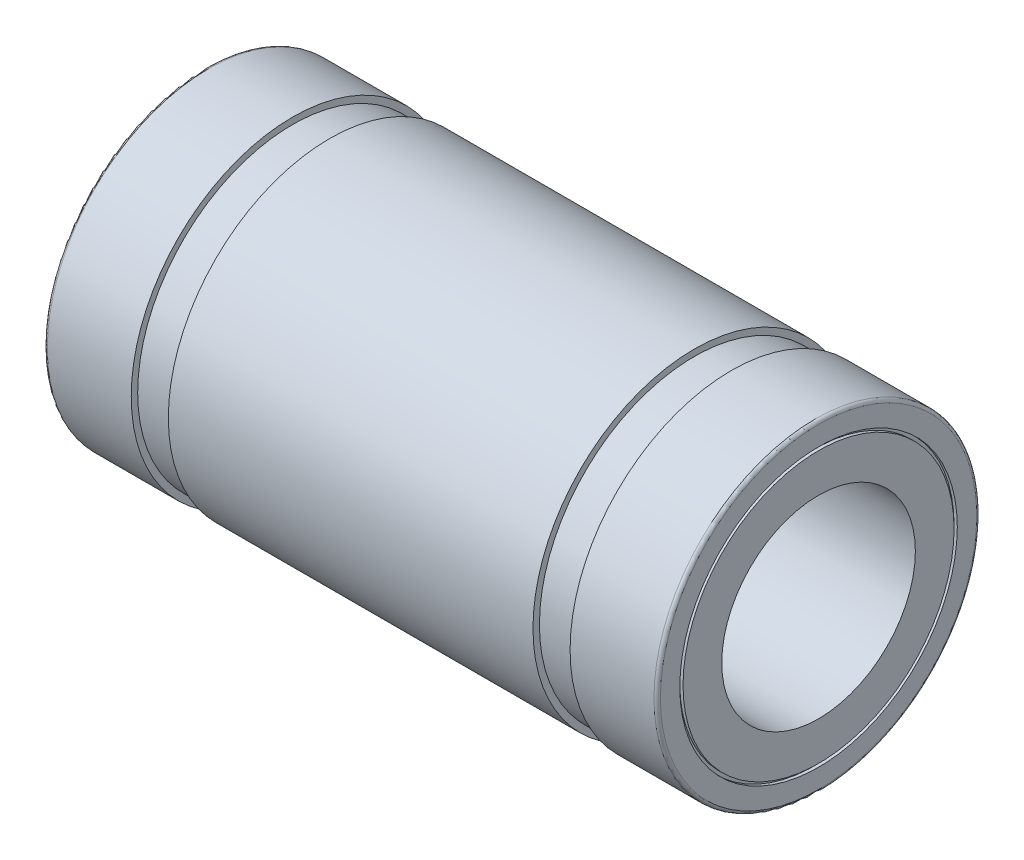
ISO-10303-21;
HEADER;
FILE_DESCRIPTION(('STEP AP214'),'2;1');
FILE_NAME('part.step','',(''),(''),'','','');
FILE_SCHEMA(('AUTOMOTIVE_DESIGN { 1 0 10303 214 1 1 1 1 }'));
ENDSEC;
DATA;
#1=APPLICATION_CONTEXT('core data for automotive mechanical design processes');
#2=APPLICATION_PROTOCOL_DEFINITION('international standard','automotive_design',2000,#1);
#3=PRODUCT_CONTEXT('',#1,'mechanical');
#4=PRODUCT('Part','Part','',(#3));
#5=PRODUCT_RELATED_PRODUCT_CATEGORY('part','',(#4));
#6=PRODUCT_DEFINITION_FORMATION('','',#4);
#7=PRODUCT_DEFINITION_CONTEXT('part definition',#1,'design');
#8=PRODUCT_DEFINITION('design','',#6,#7);
#9=PRODUCT_DEFINITION_SHAPE('','',#8);
#10=(LENGTH_UNIT() NAMED_UNIT(*) SI_UNIT(.MILLI.,.METRE.));
#11=(NAMED_UNIT(*) PLANE_ANGLE_UNIT() SI_UNIT($,.RADIAN.));
#12=(NAMED_UNIT(*) SI_UNIT($,.STERADIAN.) SOLID_ANGLE_UNIT());
#13=UNCERTAINTY_MEASURE_WITH_UNIT(LENGTH_MEASURE(1.E-05),#10,'distance_accuracy_value','');
#14=(GEOMETRIC_REPRESENTATION_CONTEXT(3) GLOBAL_UNCERTAINTY_ASSIGNED_CONTEXT((#13)) GLOBAL_UNIT_ASSIGNED_CONTEXT((#10,
#11,#12)) REPRESENTATION_CONTEXT('',''));
#15=CARTESIAN_POINT('',(0.,0.,0.));
#16=DIRECTION('',(0.,0.,1.));
#17=DIRECTION('',(1.,0.,0.));
#18=AXIS2_PLACEMENT_3D('',#15,#16,#17);
#19=CARTESIAN_POINT('',(9.4,4.3,0.));
#20=DIRECTION('',(1.,0.,0.));
#21=DIRECTION('',(0.,0.,-1.));
#22=AXIS2_PLACEMENT_3D('',#19,#20,#21);
#23=PLANE('',#22);
#24=CARTESIAN_POINT('',(9.4,0.,0.));
#25=DIRECTION('',(-1.,0.,0.));
#26=DIRECTION('',(0.,0.,1.));
#27=AXIS2_PLACEMENT_3D('',#24,#25,#26);
#28=CIRCLE('',#27,4.2);
#29=CARTESIAN_POINT('',(9.4,0.,4.2));
#30=VERTEX_POINT('',#29);
#31=EDGE_CURVE('E10',#30,#30,#28,.T.);
#32=ORIENTED_EDGE('',*,*,#31,.T.);
#33=EDGE_LOOP('',(#32));
#34=FACE_BOUND('',#33,.T.);
#35=CARTESIAN_POINT('',(9.4,0.,0.));
#36=DIRECTION('',(-1.,0.,0.));
#37=DIRECTION('',(0.,0.,1.));
#38=AXIS2_PLACEMENT_3D('',#35,#36,#37);
#39=CIRCLE('',#38,4.3);
#40=CARTESIAN_POINT('',(9.4,0.,4.3));
#41=VERTEX_POINT('',#40);
#42=EDGE_CURVE('E101',#41,#41,#39,.T.);
#43=ORIENTED_EDGE('',*,*,#42,.F.);
#44=EDGE_LOOP('',(#43));
#45=FACE_BOUND('',#44,.T.);
#46=ADVANCED_FACE('F31',(#34,#45),#23,.T.);
#47=CARTESIAN_POINT('',(9.50000000000015,0.,0.));
#48=DIRECTION('',(-1.,0.,0.));
#49=DIRECTION('',(0.,0.,1.));
#50=AXIS2_PLACEMENT_3D('',#47,#48,#49);
#51=CYLINDRICAL_SURFACE('',#50,4.2);
#52=CARTESIAN_POINT('',(9.5,0.,0.));
#53=DIRECTION('',(-1.,0.,0.));
#54=DIRECTION('',(0.,0.,1.));
#55=AXIS2_PLACEMENT_3D('',#52,#53,#54);
#56=CIRCLE('',#55,4.2);
#57=CARTESIAN_POINT('',(9.5,0.,4.2));
#58=VERTEX_POINT('',#57);
#59=EDGE_CURVE('E37',#58,#58,#56,.T.);
#60=ORIENTED_EDGE('',*,*,#59,.T.);
#61=EDGE_LOOP('',(#60));
#62=FACE_BOUND('',#61,.T.);
#63=ORIENTED_EDGE('',*,*,#31,.F.);
#64=EDGE_LOOP('',(#63));
#65=FACE_BOUND('',#64,.T.);
#66=ADVANCED_FACE('F109',(#62,#65),#51,.T.);
#67=CARTESIAN_POINT('',(9.5,4.2,0.));
#68=DIRECTION('',(1.,0.,0.));
#69=DIRECTION('',(0.,0.,-1.));
#70=AXIS2_PLACEMENT_3D('',#67,#68,#69);
#71=PLANE('',#70);
#72=CARTESIAN_POINT('',(9.5,0.,0.));
#73=DIRECTION('',(-1.,0.,0.));
#74=DIRECTION('',(0.,0.,1.));
#75=AXIS2_PLACEMENT_3D('',#72,#73,#74);
#76=CIRCLE('',#75,3.);
#77=CARTESIAN_POINT('',(9.5,0.,3.));
#78=VERTEX_POINT('',#77);
#79=EDGE_CURVE('E41',#78,#78,#76,.T.);
#80=ORIENTED_EDGE('',*,*,#79,.T.);
#81=EDGE_LOOP('',(#80));
#82=FACE_BOUND('',#81,.T.);
#83=ORIENTED_EDGE('',*,*,#59,.F.);
#84=EDGE_LOOP('',(#83));
#85=FACE_BOUND('',#84,.T.);
#86=ADVANCED_FACE('F113',(#82,#85),#71,.T.);
#87=CARTESIAN_POINT('',(9.50000000000015,0.,0.));
#88=DIRECTION('',(-1.,0.,0.));
#89=DIRECTION('',(0.,0.,1.));
#90=AXIS2_PLACEMENT_3D('',#87,#88,#89);
#91=CYLINDRICAL_SURFACE('',#90,3.);
#92=CARTESIAN_POINT('',(-9.5,0.,0.));
#93=DIRECTION('',(-1.,0.,0.));
#94=DIRECTION('',(0.,0.,1.));
#95=AXIS2_PLACEMENT_3D('',#92,#93,#94);
#96=CIRCLE('',#95,3.);
#97=CARTESIAN_POINT('',(-9.5,0.,3.));
#98=VERTEX_POINT('',#97);
#99=EDGE_CURVE('E45',#98,#98,#96,.T.);
#100=ORIENTED_EDGE('',*,*,#99,.T.);
#101=EDGE_LOOP('',(#100));
#102=FACE_BOUND('',#101,.T.);
#103=ORIENTED_EDGE('',*,*,#79,.F.);
#104=EDGE_LOOP('',(#103));
#105=FACE_BOUND('',#104,.T.);
#106=ADVANCED_FACE('F117',(#102,#105),#91,.F.);
#107=CARTESIAN_POINT('',(-9.5,3.,0.));
#108=DIRECTION('',(-1.,0.,0.));
#109=DIRECTION('',(0.,0.,1.));
#110=AXIS2_PLACEMENT_3D('',#107,#108,#109);
#111=PLANE('',#110);
#112=CARTESIAN_POINT('',(-9.5,0.,0.));
#113=DIRECTION('',(-1.,0.,0.));
#114=DIRECTION('',(0.,0.,1.));
#115=AXIS2_PLACEMENT_3D('',#112,#113,#114);
#116=CIRCLE('',#115,4.2);
#117=CARTESIAN_POINT('',(-9.5,0.,4.2));
#118=VERTEX_POINT('',#117);
#119=EDGE_CURVE('E50',#118,#118,#116,.T.);
#120=ORIENTED_EDGE('',*,*,#119,.T.);
#121=EDGE_LOOP('',(#120));
#122=FACE_BOUND('',#121,.T.);
#123=ORIENTED_EDGE('',*,*,#99,.F.);
#124=EDGE_LOOP('',(#123));
#125=FACE_BOUND('',#124,.T.);
#126=ADVANCED_FACE('F124',(#122,#125),#111,.T.);
#127=CARTESIAN_POINT('',(9.50000000000015,0.,0.));
#128=DIRECTION('',(-1.,0.,0.));
#129=DIRECTION('',(0.,0.,1.));
#130=AXIS2_PLACEMENT_3D('',#127,#128,#129);
#131=CYLINDRICAL_SURFACE('',#130,4.2);
#132=CARTESIAN_POINT('',(-9.4,0.,0.));
#133=DIRECTION('',(-1.,0.,0.));
#134=DIRECTION('',(0.,0.,1.));
#135=AXIS2_PLACEMENT_3D('',#132,#133,#134);
#136=CIRCLE('',#135,4.2);
#137=CARTESIAN_POINT('',(-9.4,0.,4.2));
#138=VERTEX_POINT('',#137);
#139=EDGE_CURVE('E53',#138,#138,#136,.T.);
#140=ORIENTED_EDGE('',*,*,#139,.T.);
#141=EDGE_LOOP('',(#140));
#142=FACE_BOUND('',#141,.T.);
#143=ORIENTED_EDGE('',*,*,#119,.F.);
#144=EDGE_LOOP('',(#143));
#145=FACE_BOUND('',#144,.T.);
#146=ADVANCED_FACE('F128',(#142,#145),#131,.T.);
#147=CARTESIAN_POINT('',(-9.4,4.2,0.));
#148=DIRECTION('',(-1.,0.,0.));
#149=DIRECTION('',(0.,0.,1.));
#150=AXIS2_PLACEMENT_3D('',#147,#148,#149);
#151=PLANE('',#150);
#152=CARTESIAN_POINT('',(-9.4,0.,0.));
#153=DIRECTION('',(-1.,0.,0.));
#154=DIRECTION('',(0.,0.,1.));
#155=AXIS2_PLACEMENT_3D('',#152,#153,#154);
#156=CIRCLE('',#155,4.3);
#157=CARTESIAN_POINT('',(-9.4,0.,4.3));
#158=VERTEX_POINT('',#157);
#159=EDGE_CURVE('E56',#158,#158,#156,.T.);
#160=ORIENTED_EDGE('',*,*,#159,.T.);
#161=EDGE_LOOP('',(#160));
#162=FACE_BOUND('',#161,.T.);
#163=ORIENTED_EDGE('',*,*,#139,.F.);
#164=EDGE_LOOP('',(#163));
#165=FACE_BOUND('',#164,.T.);
#166=ADVANCED_FACE('F132',(#162,#165),#151,.T.);
#167=CARTESIAN_POINT('',(9.50000000000015,0.,0.));
#168=DIRECTION('',(-1.,0.,0.));
#169=DIRECTION('',(0.,0.,1.));
#170=AXIS2_PLACEMENT_3D('',#167,#168,#169);
#171=CYLINDRICAL_SURFACE('',#170,4.3);
#172=CARTESIAN_POINT('',(-9.5,0.,0.));
#173=DIRECTION('',(-1.,0.,0.));
#174=DIRECTION('',(0.,0.,1.));
#175=AXIS2_PLACEMENT_3D('',#172,#173,#174);
#176=CIRCLE('',#175,4.3);
#177=CARTESIAN_POINT('',(-9.5,0.,4.3));
#178=VERTEX_POINT('',#177);
#179=EDGE_CURVE('E59',#178,#178,#176,.T.);
#180=ORIENTED_EDGE('',*,*,#179,.T.);
#181=EDGE_LOOP('',(#180));
#182=FACE_BOUND('',#181,.T.);
#183=ORIENTED_EDGE('',*,*,#159,.F.);
#184=EDGE_LOOP('',(#183));
#185=FACE_BOUND('',#184,.T.);
#186=ADVANCED_FACE('F136',(#182,#185),#171,.F.);
#187=CARTESIAN_POINT('',(-9.5,4.3,0.));
#188=DIRECTION('',(-1.,0.,0.));
#189=DIRECTION('',(0.,0.,1.));
#190=AXIS2_PLACEMENT_3D('',#187,#188,#189);
#191=PLANE('',#190);
#192=CARTESIAN_POINT('',(-9.5,0.,0.));
#193=DIRECTION('',(-1.,0.,0.));
#194=DIRECTION('',(0.,0.,1.));
#195=AXIS2_PLACEMENT_3D('',#192,#193,#194);
#196=CIRCLE('',#195,4.9);
#197=CARTESIAN_POINT('',(-9.5,0.,4.9));
#198=VERTEX_POINT('',#197);
#199=EDGE_CURVE('E62',#198,#198,#196,.T.);
#200=ORIENTED_EDGE('',*,*,#199,.T.);
#201=EDGE_LOOP('',(#200));
#202=FACE_BOUND('',#201,.T.);
#203=ORIENTED_EDGE('',*,*,#179,.F.);
#204=EDGE_LOOP('',(#203));
#205=FACE_BOUND('',#204,.T.);
#206=ADVANCED_FACE('F140',(#202,#205),#191,.T.);
#207=CARTESIAN_POINT('',(-9.40000000000015,0.,0.));
#208=DIRECTION('',(-1.,0.,0.));
#209=DIRECTION('',(0.,0.,1.));
#210=AXIS2_PLACEMENT_3D('',#207,#208,#209);
#211=TOROIDAL_SURFACE('',#210,4.9,0.0999999999999252);
#212=CARTESIAN_POINT('',(-9.4,0.,0.));
#213=DIRECTION('',(-1.,0.,0.));
#214=DIRECTION('',(0.,0.,1.));
#215=AXIS2_PLACEMENT_3D('',#212,#213,#214);
#216=CIRCLE('',#215,4.99999999999993);
#217=CARTESIAN_POINT('',(-9.4,0.,4.99999999999993));
#218=VERTEX_POINT('',#217);
#219=EDGE_CURVE('E65',#218,#218,#216,.T.);
#220=ORIENTED_EDGE('',*,*,#219,.T.);
#221=EDGE_LOOP('',(#220));
#222=FACE_BOUND('',#221,.T.);
#223=ORIENTED_EDGE('',*,*,#199,.F.);
#224=EDGE_LOOP('',(#223));
#225=FACE_BOUND('',#224,.T.);
#226=ADVANCED_FACE('F144',(#222,#225),#211,.T.);
#227=CARTESIAN_POINT('',(9.50000000000015,0.,0.));
#228=DIRECTION('',(-1.,0.,0.));
#229=DIRECTION('',(0.,0.,1.));
#230=AXIS2_PLACEMENT_3D('',#227,#228,#229);
#231=CYLINDRICAL_SURFACE('',#230,4.99999999999996);
#232=CARTESIAN_POINT('',(-6.8,0.,0.));
#233=DIRECTION('',(-1.,0.,0.));
#234=DIRECTION('',(0.,0.,1.));
#235=AXIS2_PLACEMENT_3D('',#232,#233,#234);
#236=CIRCLE('',#235,5.);
#237=CARTESIAN_POINT('',(-6.8,0.,5.));
#238=VERTEX_POINT('',#237);
#239=EDGE_CURVE('E68',#238,#238,#236,.T.);
#240=ORIENTED_EDGE('',*,*,#239,.T.);
#241=EDGE_LOOP('',(#240));
#242=FACE_BOUND('',#241,.T.);
#243=ORIENTED_EDGE('',*,*,#219,.F.);
#244=EDGE_LOOP('',(#243));
#245=FACE_BOUND('',#244,.T.);
#246=ADVANCED_FACE('F148',(#242,#245),#231,.T.);
#247=CARTESIAN_POINT('',(-6.8,5.,0.));
#248=DIRECTION('',(1.,0.,0.));
#249=DIRECTION('',(0.,0.,-1.));
#250=AXIS2_PLACEMENT_3D('',#247,#248,#249);
#251=PLANE('',#250);
#252=CARTESIAN_POINT('',(-6.8,0.,0.));
#253=DIRECTION('',(-1.,0.,0.));
#254=DIRECTION('',(0.,0.,1.));
#255=AXIS2_PLACEMENT_3D('',#252,#253,#254);
#256=CIRCLE('',#255,4.8);
#257=CARTESIAN_POINT('',(-6.8,0.,4.8));
#258=VERTEX_POINT('',#257);
#259=EDGE_CURVE('E71',#258,#258,#256,.T.);
#260=ORIENTED_EDGE('',*,*,#259,.T.);
#261=EDGE_LOOP('',(#260));
#262=FACE_BOUND('',#261,.T.);
#263=ORIENTED_EDGE('',*,*,#239,.F.);
#264=EDGE_LOOP('',(#263));
#265=FACE_BOUND('',#264,.T.);
#266=ADVANCED_FACE('F152',(#262,#265),#251,.T.);
#267=CARTESIAN_POINT('',(9.50000000000015,0.,0.));
#268=DIRECTION('',(-1.,0.,0.));
#269=DIRECTION('',(0.,0.,1.));
#270=AXIS2_PLACEMENT_3D('',#267,#268,#269);
#271=CYLINDRICAL_SURFACE('',#270,4.8);
#272=CARTESIAN_POINT('',(-5.65,0.,0.));
#273=DIRECTION('',(-1.,0.,0.));
#274=DIRECTION('',(0.,0.,1.));
#275=AXIS2_PLACEMENT_3D('',#272,#273,#274);
#276=CIRCLE('',#275,4.8);
#277=CARTESIAN_POINT('',(-5.65,0.,4.8));
#278=VERTEX_POINT('',#277);
#279=EDGE_CURVE('E74',#278,#278,#276,.T.);
#280=ORIENTED_EDGE('',*,*,#279,.T.);
#281=EDGE_LOOP('',(#280));
#282=FACE_BOUND('',#281,.T.);
#283=ORIENTED_EDGE('',*,*,#259,.F.);
#284=EDGE_LOOP('',(#283));
#285=FACE_BOUND('',#284,.T.);
#286=ADVANCED_FACE('F156',(#282,#285),#271,.T.);
#287=CARTESIAN_POINT('',(-5.65,4.8,0.));
#288=DIRECTION('',(-1.,0.,0.));
#289=DIRECTION('',(0.,0.,1.));
#290=AXIS2_PLACEMENT_3D('',#287,#288,#289);
#291=PLANE('',#290);
#292=CARTESIAN_POINT('',(-5.65,0.,0.));
#293=DIRECTION('',(-1.,0.,0.));
#294=DIRECTION('',(0.,0.,1.));
#295=AXIS2_PLACEMENT_3D('',#292,#293,#294);
#296=CIRCLE('',#295,5.);
#297=CARTESIAN_POINT('',(-5.65,0.,5.));
#298=VERTEX_POINT('',#297);
#299=EDGE_CURVE('E77',#298,#298,#296,.T.);
#300=ORIENTED_EDGE('',*,*,#299,.T.);
#301=EDGE_LOOP('',(#300));
#302=FACE_BOUND('',#301,.T.);
#303=ORIENTED_EDGE('',*,*,#279,.F.);
#304=EDGE_LOOP('',(#303));
#305=FACE_BOUND('',#304,.T.);
#306=ADVANCED_FACE('F160',(#302,#305),#291,.T.);
#307=CARTESIAN_POINT('',(9.50000000000015,0.,0.));
#308=DIRECTION('',(-1.,0.,0.));
#309=DIRECTION('',(0.,0.,1.));
#310=AXIS2_PLACEMENT_3D('',#307,#308,#309);
#311=CYLINDRICAL_SURFACE('',#310,5.);
#312=CARTESIAN_POINT('',(5.65,0.,0.));
#313=DIRECTION('',(-1.,0.,0.));
#314=DIRECTION('',(0.,0.,1.));
#315=AXIS2_PLACEMENT_3D('',#312,#313,#314);
#316=CIRCLE('',#315,5.);
#317=CARTESIAN_POINT('',(5.65,0.,5.));
#318=VERTEX_POINT('',#317);
#319=EDGE_CURVE('E80',#318,#318,#316,.T.);
#320=ORIENTED_EDGE('',*,*,#319,.T.);
#321=EDGE_LOOP('',(#320));
#322=FACE_BOUND('',#321,.T.);
#323=ORIENTED_EDGE('',*,*,#299,.F.);
#324=EDGE_LOOP('',(#323));
#325=FACE_BOUND('',#324,.T.);
#326=ADVANCED_FACE('F164',(#322,#325),#311,.T.);
#327=CARTESIAN_POINT('',(5.65,5.,0.));
#328=DIRECTION('',(1.,0.,0.));
#329=DIRECTION('',(0.,0.,-1.));
#330=AXIS2_PLACEMENT_3D('',#327,#328,#329);
#331=PLANE('',#330);
#332=CARTESIAN_POINT('',(5.65,0.,0.));
#333=DIRECTION('',(-1.,0.,0.));
#334=DIRECTION('',(0.,0.,1.));
#335=AXIS2_PLACEMENT_3D('',#332,#333,#334);
#336=CIRCLE('',#335,4.8);
#337=CARTESIAN_POINT('',(5.65,0.,4.8));
#338=VERTEX_POINT('',#337);
#339=EDGE_CURVE('E83',#338,#338,#336,.T.);
#340=ORIENTED_EDGE('',*,*,#339,.T.);
#341=EDGE_LOOP('',(#340));
#342=FACE_BOUND('',#341,.T.);
#343=ORIENTED_EDGE('',*,*,#319,.F.);
#344=EDGE_LOOP('',(#343));
#345=FACE_BOUND('',#344,.T.);
#346=ADVANCED_FACE('F168',(#342,#345),#331,.T.);
#347=CARTESIAN_POINT('',(9.50000000000015,0.,0.));
#348=DIRECTION('',(-1.,0.,0.));
#349=DIRECTION('',(0.,0.,1.));
#350=AXIS2_PLACEMENT_3D('',#347,#348,#349);
#351=CYLINDRICAL_SURFACE('',#350,4.8);
#352=CARTESIAN_POINT('',(6.8,0.,0.));
#353=DIRECTION('',(-1.,0.,0.));
#354=DIRECTION('',(0.,0.,1.));
#355=AXIS2_PLACEMENT_3D('',#352,#353,#354);
#356=CIRCLE('',#355,4.8);
#357=CARTESIAN_POINT('',(6.8,0.,4.8));
#358=VERTEX_POINT('',#357);
#359=EDGE_CURVE('E86',#358,#358,#356,.T.);
#360=ORIENTED_EDGE('',*,*,#359,.T.);
#361=EDGE_LOOP('',(#360));
#362=FACE_BOUND('',#361,.T.);
#363=ORIENTED_EDGE('',*,*,#339,.F.);
#364=EDGE_LOOP('',(#363));
#365=FACE_BOUND('',#364,.T.);
#366=ADVANCED_FACE('F172',(#362,#365),#351,.T.);
#367=CARTESIAN_POINT('',(6.8,4.8,0.));
#368=DIRECTION('',(-1.,0.,0.));
#369=DIRECTION('',(0.,0.,1.));
#370=AXIS2_PLACEMENT_3D('',#367,#368,#369);
#371=PLANE('',#370);
#372=CARTESIAN_POINT('',(6.8,0.,0.));
#373=DIRECTION('',(-1.,0.,0.));
#374=DIRECTION('',(0.,0.,1.));
#375=AXIS2_PLACEMENT_3D('',#372,#373,#374);
#376=CIRCLE('',#375,5.);
#377=CARTESIAN_POINT('',(6.8,0.,5.));
#378=VERTEX_POINT('',#377);
#379=EDGE_CURVE('E89',#378,#378,#376,.T.);
#380=ORIENTED_EDGE('',*,*,#379,.T.);
#381=EDGE_LOOP('',(#380));
#382=FACE_BOUND('',#381,.T.);
#383=ORIENTED_EDGE('',*,*,#359,.F.);
#384=EDGE_LOOP('',(#383));
#385=FACE_BOUND('',#384,.T.);
#386=ADVANCED_FACE('F176',(#382,#385),#371,.T.);
#387=CARTESIAN_POINT('',(9.50000000000015,0.,0.));
#388=DIRECTION('',(-1.,0.,0.));
#389=DIRECTION('',(0.,0.,1.));
#390=AXIS2_PLACEMENT_3D('',#387,#388,#389);
#391=CYLINDRICAL_SURFACE('',#390,5.);
#392=CARTESIAN_POINT('',(9.4,0.,0.));
#393=DIRECTION('',(-1.,0.,0.));
#394=DIRECTION('',(0.,0.,1.));
#395=AXIS2_PLACEMENT_3D('',#392,#393,#394);
#396=CIRCLE('',#395,5.);
#397=CARTESIAN_POINT('',(9.4,0.,5.));
#398=VERTEX_POINT('',#397);
#399=EDGE_CURVE('E92',#398,#398,#396,.T.);
#400=ORIENTED_EDGE('',*,*,#399,.T.);
#401=EDGE_LOOP('',(#400));
#402=FACE_BOUND('',#401,.T.);
#403=ORIENTED_EDGE('',*,*,#379,.F.);
#404=EDGE_LOOP('',(#403));
#405=FACE_BOUND('',#404,.T.);
#406=ADVANCED_FACE('F180',(#402,#405),#391,.T.);
#407=CARTESIAN_POINT('',(9.40000000000015,0.,0.));
#408=DIRECTION('',(-1.,0.,0.));
#409=DIRECTION('',(0.,0.,1.));
#410=AXIS2_PLACEMENT_3D('',#407,#408,#409);
#411=TOROIDAL_SURFACE('',#410,4.9,0.0999999999999621);
#412=CARTESIAN_POINT('',(9.50000000000011,0.,0.));
#413=DIRECTION('',(-1.,0.,0.));
#414=DIRECTION('',(0.,0.,1.));
#415=AXIS2_PLACEMENT_3D('',#412,#413,#414);
#416=CIRCLE('',#415,4.9);
#417=CARTESIAN_POINT('',(9.50000000000011,0.,4.9));
#418=VERTEX_POINT('',#417);
#419=EDGE_CURVE('E95',#418,#418,#416,.T.);
#420=ORIENTED_EDGE('',*,*,#419,.T.);
#421=EDGE_LOOP('',(#420));
#422=FACE_BOUND('',#421,.T.);
#423=ORIENTED_EDGE('',*,*,#399,.F.);
#424=EDGE_LOOP('',(#423));
#425=FACE_BOUND('',#424,.T.);
#426=ADVANCED_FACE('F184',(#422,#425),#411,.T.);
#427=CARTESIAN_POINT('',(9.50000000000006,4.9,0.));
#428=DIRECTION('',(1.,0.,0.));
#429=DIRECTION('',(0.,0.,-1.));
#430=AXIS2_PLACEMENT_3D('',#427,#428,#429);
#431=PLANE('',#430);
#432=CARTESIAN_POINT('',(9.5,0.,0.));
#433=DIRECTION('',(-1.,0.,0.));
#434=DIRECTION('',(0.,0.,1.));
#435=AXIS2_PLACEMENT_3D('',#432,#433,#434);
#436=CIRCLE('',#435,4.3);
#437=CARTESIAN_POINT('',(9.5,0.,4.3));
#438=VERTEX_POINT('',#437);
#439=EDGE_CURVE('E98',#438,#438,#436,.T.);
#440=ORIENTED_EDGE('',*,*,#439,.T.);
#441=EDGE_LOOP('',(#440));
#442=FACE_BOUND('',#441,.T.);
#443=ORIENTED_EDGE('',*,*,#419,.F.);
#444=EDGE_LOOP('',(#443));
#445=FACE_BOUND('',#444,.T.);
#446=ADVANCED_FACE('F188',(#442,#445),#431,.T.);
#447=CARTESIAN_POINT('',(9.50000000000015,0.,0.));
#448=DIRECTION('',(-1.,0.,0.));
#449=DIRECTION('',(0.,0.,1.));
#450=AXIS2_PLACEMENT_3D('',#447,#448,#449);
#451=CYLINDRICAL_SURFACE('',#450,4.3);
#452=ORIENTED_EDGE('',*,*,#42,.T.);
#453=EDGE_LOOP('',(#452));
#454=FACE_BOUND('',#453,.T.);
#455=ORIENTED_EDGE('',*,*,#439,.F.);
#456=EDGE_LOOP('',(#455));
#457=FACE_BOUND('',#456,.T.);
#458=ADVANCED_FACE('F105',(#454,#457),#451,.F.);
#459=CLOSED_SHELL('',(#46,#66,#86,#106,#126,#146,#166,#186,#206,#226,#246,#266,#286,#306,#326,
#346,#366,#386,#406,#426,#446,#458));
#460=MANIFOLD_SOLID_BREP('B2',#459);
#461=ADVANCED_BREP_SHAPE_REPRESENTATION('',(#18,#460),#14);
#462=SHAPE_DEFINITION_REPRESENTATION(#9,#461);
ENDSEC;
END-ISO-10303-21;
